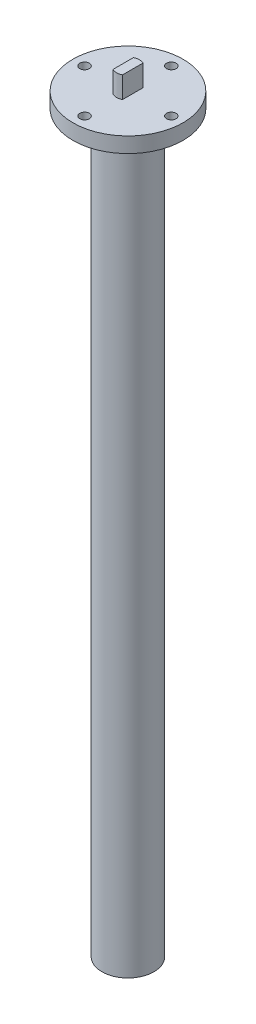
ISO-10303-21;
HEADER;
FILE_DESCRIPTION(('STEP AP214'),'2;1');
FILE_NAME('part.step','',(''),(''),'','','');
FILE_SCHEMA(('AUTOMOTIVE_DESIGN { 1 0 10303 214 1 1 1 1 }'));
ENDSEC;
DATA;
#1=APPLICATION_CONTEXT('core data for automotive mechanical design processes');
#2=APPLICATION_PROTOCOL_DEFINITION('international standard','automotive_design',2000,#1);
#3=PRODUCT_CONTEXT('',#1,'mechanical');
#4=PRODUCT('Part','Part','',(#3));
#5=PRODUCT_RELATED_PRODUCT_CATEGORY('part','',(#4));
#6=PRODUCT_DEFINITION_FORMATION('','',#4);
#7=PRODUCT_DEFINITION_CONTEXT('part definition',#1,'design');
#8=PRODUCT_DEFINITION('design','',#6,#7);
#9=PRODUCT_DEFINITION_SHAPE('','',#8);
#10=(LENGTH_UNIT() NAMED_UNIT(*) SI_UNIT(.MILLI.,.METRE.));
#11=(NAMED_UNIT(*) PLANE_ANGLE_UNIT() SI_UNIT($,.RADIAN.));
#12=(NAMED_UNIT(*) SI_UNIT($,.STERADIAN.) SOLID_ANGLE_UNIT());
#13=UNCERTAINTY_MEASURE_WITH_UNIT(LENGTH_MEASURE(1.E-05),#10,'distance_accuracy_value','');
#14=(GEOMETRIC_REPRESENTATION_CONTEXT(3) GLOBAL_UNCERTAINTY_ASSIGNED_CONTEXT((#13)) GLOBAL_UNIT_ASSIGNED_CONTEXT((#10,
#11,#12)) REPRESENTATION_CONTEXT('',''));
#15=CARTESIAN_POINT('',(0.,0.,0.));
#16=DIRECTION('',(0.,0.,1.));
#17=DIRECTION('',(1.,0.,0.));
#18=AXIS2_PLACEMENT_3D('',#15,#16,#17);
#19=CARTESIAN_POINT('',(0.,6.35,0.));
#20=DIRECTION('',(0.,1.,0.));
#21=DIRECTION('',(0.,0.,1.));
#22=AXIS2_PLACEMENT_3D('',#19,#20,#21);
#23=PLANE('',#22);
#24=CARTESIAN_POINT('',(18.,6.35,-1.88539992297529E-13));
#25=DIRECTION('',(0.,1.,0.));
#26=DIRECTION('',(0.,0.,1.));
#27=AXIS2_PLACEMENT_3D('',#24,#25,#26);
#28=CIRCLE('',#27,1.984375);
#29=CARTESIAN_POINT('',(18.,6.35,1.98437499999981));
#30=VERTEX_POINT('',#29);
#31=EDGE_CURVE('E188',#30,#30,#28,.T.);
#32=ORIENTED_EDGE('',*,*,#31,.F.);
#33=EDGE_LOOP('',(#32));
#34=FACE_BOUND('',#33,.T.);
#35=CARTESIAN_POINT('',(0.,6.35,18.));
#36=DIRECTION('',(0.,1.,0.));
#37=DIRECTION('',(0.,0.,1.));
#38=AXIS2_PLACEMENT_3D('',#35,#36,#37);
#39=CIRCLE('',#38,1.984375);
#40=CARTESIAN_POINT('',(0.,6.35,19.984375));
#41=VERTEX_POINT('',#40);
#42=EDGE_CURVE('E184',#41,#41,#39,.T.);
#43=ORIENTED_EDGE('',*,*,#42,.F.);
#44=EDGE_LOOP('',(#43));
#45=FACE_BOUND('',#44,.T.);
#46=CARTESIAN_POINT('',(-18.,6.35,0.));
#47=DIRECTION('',(0.,1.,0.));
#48=DIRECTION('',(0.,0.,1.));
#49=AXIS2_PLACEMENT_3D('',#46,#47,#48);
#50=CIRCLE('',#49,1.984375);
#51=CARTESIAN_POINT('',(-18.,6.35,1.98437500000006));
#52=VERTEX_POINT('',#51);
#53=EDGE_CURVE('E180',#52,#52,#50,.T.);
#54=ORIENTED_EDGE('',*,*,#53,.F.);
#55=EDGE_LOOP('',(#54));
#56=FACE_BOUND('',#55,.T.);
#57=CARTESIAN_POINT('',(0.,6.35,-18.));
#58=DIRECTION('',(0.,1.,0.));
#59=DIRECTION('',(0.,0.,1.));
#60=AXIS2_PLACEMENT_3D('',#57,#58,#59);
#61=CIRCLE('',#60,1.984375);
#62=CARTESIAN_POINT('',(0.,6.35,-16.015625));
#63=VERTEX_POINT('',#62);
#64=EDGE_CURVE('E174',#63,#63,#61,.T.);
#65=ORIENTED_EDGE('',*,*,#64,.F.);
#66=EDGE_LOOP('',(#65));
#67=FACE_BOUND('',#66,.T.);
#68=CARTESIAN_POINT('',(0.,6.35,0.));
#69=DIRECTION('',(0.,1.,0.));
#70=DIRECTION('',(0.,0.,1.));
#71=AXIS2_PLACEMENT_3D('',#68,#69,#70);
#72=CIRCLE('',#71,22.86);
#73=CARTESIAN_POINT('',(0.,6.35,22.86));
#74=VERTEX_POINT('',#73);
#75=EDGE_CURVE('E112',#74,#74,#72,.T.);
#76=ORIENTED_EDGE('',*,*,#75,.T.);
#77=EDGE_LOOP('',(#76));
#78=FACE_BOUND('',#77,.T.);
#79=CARTESIAN_POINT('',(0.,6.35,0.));
#80=DIRECTION('',(0.,1.,0.));
#81=DIRECTION('',(0.,0.,1.));
#82=AXIS2_PLACEMENT_3D('',#79,#80,#81);
#83=CIRCLE('',#82,4.699);
#84=CARTESIAN_POINT('',(1.9685,6.35,-4.26680310654242));
#85=VERTEX_POINT('',#84);
#86=CARTESIAN_POINT('',(-1.9685,6.35,-4.26680310654242));
#87=VERTEX_POINT('',#86);
#88=EDGE_CURVE('E98',#85,#87,#83,.T.);
#89=ORIENTED_EDGE('',*,*,#88,.F.);
#90=DIRECTION('',(0.,0.,1.));
#91=VECTOR('',#90,1.);
#92=CARTESIAN_POINT('',(1.9685,6.35,0.));
#93=LINE('',#92,#91);
#94=CARTESIAN_POINT('',(1.9685,6.35,4.26680310654242));
#95=VERTEX_POINT('',#94);
#96=EDGE_CURVE('E48',#85,#95,#93,.T.);
#97=ORIENTED_EDGE('',*,*,#96,.T.);
#98=CARTESIAN_POINT('',(-1.9685,6.35,4.26680310654241));
#99=VERTEX_POINT('',#98);
#100=EDGE_CURVE('E53',#99,#95,#83,.T.);
#101=ORIENTED_EDGE('',*,*,#100,.F.);
#102=DIRECTION('',(0.,0.,1.));
#103=VECTOR('',#102,1.);
#104=CARTESIAN_POINT('',(-1.9685,6.35,0.));
#105=LINE('',#104,#103);
#106=EDGE_CURVE('E96',#87,#99,#105,.T.);
#107=ORIENTED_EDGE('',*,*,#106,.F.);
#108=EDGE_LOOP('',(#89,#97,#101,#107));
#109=FACE_BOUND('',#108,.T.);
#110=ADVANCED_FACE('F33',(#34,#45,#56,#67,#78,#109),#23,.T.);
#111=CARTESIAN_POINT('',(0.,6.35,0.));
#112=DIRECTION('',(0.,-1.,0.));
#113=DIRECTION('',(0.,0.,-1.));
#114=AXIS2_PLACEMENT_3D('',#111,#112,#113);
#115=CYLINDRICAL_SURFACE('',#114,22.86);
#116=ORIENTED_EDGE('',*,*,#75,.F.);
#117=EDGE_LOOP('',(#116));
#118=FACE_BOUND('',#117,.T.);
#119=CARTESIAN_POINT('',(0.,0.,0.));
#120=DIRECTION('',(0.,1.,0.));
#121=DIRECTION('',(0.,0.,1.));
#122=AXIS2_PLACEMENT_3D('',#119,#120,#121);
#123=CIRCLE('',#122,22.86);
#124=CARTESIAN_POINT('',(0.,0.,22.86));
#125=VERTEX_POINT('',#124);
#126=EDGE_CURVE('E80',#125,#125,#123,.T.);
#127=ORIENTED_EDGE('',*,*,#126,.T.);
#128=EDGE_LOOP('',(#127));
#129=FACE_BOUND('',#128,.T.);
#130=ADVANCED_FACE('F137',(#118,#129),#115,.T.);
#131=CARTESIAN_POINT('',(0.,0.,0.));
#132=DIRECTION('',(0.,1.,0.));
#133=DIRECTION('',(0.,0.,1.));
#134=AXIS2_PLACEMENT_3D('',#131,#132,#133);
#135=PLANE('',#134);
#136=CARTESIAN_POINT('',(18.,0.,-1.88539992297529E-13));
#137=DIRECTION('',(0.,1.,0.));
#138=DIRECTION('',(0.,0.,1.));
#139=AXIS2_PLACEMENT_3D('',#136,#137,#138);
#140=CIRCLE('',#139,1.984375);
#141=CARTESIAN_POINT('',(18.,0.,1.98437499999981));
#142=VERTEX_POINT('',#141);
#143=EDGE_CURVE('E158',#142,#142,#140,.T.);
#144=ORIENTED_EDGE('',*,*,#143,.T.);
#145=EDGE_LOOP('',(#144));
#146=FACE_BOUND('',#145,.T.);
#147=CARTESIAN_POINT('',(0.,0.,18.));
#148=DIRECTION('',(0.,1.,0.));
#149=DIRECTION('',(0.,0.,1.));
#150=AXIS2_PLACEMENT_3D('',#147,#148,#149);
#151=CIRCLE('',#150,1.984375);
#152=CARTESIAN_POINT('',(0.,0.,19.984375));
#153=VERTEX_POINT('',#152);
#154=EDGE_CURVE('E162',#153,#153,#151,.T.);
#155=ORIENTED_EDGE('',*,*,#154,.T.);
#156=EDGE_LOOP('',(#155));
#157=FACE_BOUND('',#156,.T.);
#158=CARTESIAN_POINT('',(-18.,0.,0.));
#159=DIRECTION('',(0.,1.,0.));
#160=DIRECTION('',(0.,0.,1.));
#161=AXIS2_PLACEMENT_3D('',#158,#159,#160);
#162=CIRCLE('',#161,1.984375);
#163=CARTESIAN_POINT('',(-18.,0.,1.98437500000006));
#164=VERTEX_POINT('',#163);
#165=EDGE_CURVE('E166',#164,#164,#162,.T.);
#166=ORIENTED_EDGE('',*,*,#165,.T.);
#167=EDGE_LOOP('',(#166));
#168=FACE_BOUND('',#167,.T.);
#169=CARTESIAN_POINT('',(0.,0.,-18.));
#170=DIRECTION('',(0.,1.,0.));
#171=DIRECTION('',(0.,0.,1.));
#172=AXIS2_PLACEMENT_3D('',#169,#170,#171);
#173=CIRCLE('',#172,1.984375);
#174=CARTESIAN_POINT('',(0.,0.,-16.015625));
#175=VERTEX_POINT('',#174);
#176=EDGE_CURVE('E170',#175,#175,#173,.T.);
#177=ORIENTED_EDGE('',*,*,#176,.T.);
#178=EDGE_LOOP('',(#177));
#179=FACE_BOUND('',#178,.T.);
#180=CARTESIAN_POINT('',(0.,0.,0.));
#181=DIRECTION('',(0.,1.,0.));
#182=DIRECTION('',(0.,0.,1.));
#183=AXIS2_PLACEMENT_3D('',#180,#181,#182);
#184=CIRCLE('',#183,14.6050000000003);
#185=CARTESIAN_POINT('',(0.,0.,14.6050000000003));
#186=VERTEX_POINT('',#185);
#187=EDGE_CURVE('E11',#186,#186,#184,.T.);
#188=ORIENTED_EDGE('',*,*,#187,.T.);
#189=EDGE_LOOP('',(#188));
#190=FACE_BOUND('',#189,.T.);
#191=ORIENTED_EDGE('',*,*,#126,.F.);
#192=EDGE_LOOP('',(#191));
#193=FACE_BOUND('',#192,.T.);
#194=ADVANCED_FACE('F143',(#146,#157,#168,#179,#190,#193),#135,.F.);
#195=CARTESIAN_POINT('',(1.9685,15.24,0.));
#196=DIRECTION('',(1.,0.,0.));
#197=DIRECTION('',(0.,0.,-1.));
#198=AXIS2_PLACEMENT_3D('',#195,#196,#197);
#199=PLANE('',#198);
#200=ORIENTED_EDGE('',*,*,#96,.F.);
#201=DIRECTION('',(0.,-1.,0.));
#202=VECTOR('',#201,1.);
#203=CARTESIAN_POINT('',(1.9685,15.24,-4.26680310654242));
#204=LINE('',#203,#202);
#205=CARTESIAN_POINT('',(1.9685,15.24,-4.26680310654242));
#206=VERTEX_POINT('',#205);
#207=EDGE_CURVE('E73',#206,#85,#204,.T.);
#208=ORIENTED_EDGE('',*,*,#207,.F.);
#209=DIRECTION('',(0.,0.,1.));
#210=VECTOR('',#209,1.);
#211=CARTESIAN_POINT('',(1.9685,15.24,0.));
#212=LINE('',#211,#210);
#213=CARTESIAN_POINT('',(1.9685,15.24,4.26680310654242));
#214=VERTEX_POINT('',#213);
#215=EDGE_CURVE('E77',#206,#214,#212,.T.);
#216=ORIENTED_EDGE('',*,*,#215,.T.);
#217=DIRECTION('',(0.,-1.,0.));
#218=VECTOR('',#217,1.);
#219=CARTESIAN_POINT('',(1.9685,15.24,4.26680310654242));
#220=LINE('',#219,#218);
#221=EDGE_CURVE('E106',#214,#95,#220,.T.);
#222=ORIENTED_EDGE('',*,*,#221,.T.);
#223=EDGE_LOOP('',(#200,#208,#216,#222));
#224=FACE_BOUND('',#223,.T.);
#225=ADVANCED_FACE('F75',(#224),#199,.T.);
#226=CARTESIAN_POINT('',(0.,15.24,0.));
#227=DIRECTION('',(0.,-1.,0.));
#228=DIRECTION('',(0.,0.,-1.));
#229=AXIS2_PLACEMENT_3D('',#226,#227,#228);
#230=CYLINDRICAL_SURFACE('',#229,4.699);
#231=ORIENTED_EDGE('',*,*,#88,.T.);
#232=DIRECTION('',(0.,-1.,0.));
#233=VECTOR('',#232,1.);
#234=CARTESIAN_POINT('',(-1.9685,15.24,-4.26680310654242));
#235=LINE('',#234,#233);
#236=CARTESIAN_POINT('',(-1.9685,15.24,-4.26680310654242));
#237=VERTEX_POINT('',#236);
#238=EDGE_CURVE('E81',#237,#87,#235,.T.);
#239=ORIENTED_EDGE('',*,*,#238,.F.);
#240=CARTESIAN_POINT('',(0.,15.24,0.));
#241=DIRECTION('',(0.,1.,0.));
#242=DIRECTION('',(0.,0.,1.));
#243=AXIS2_PLACEMENT_3D('',#240,#241,#242);
#244=CIRCLE('',#243,4.699);
#245=EDGE_CURVE('E84',#206,#237,#244,.T.);
#246=ORIENTED_EDGE('',*,*,#245,.F.);
#247=ORIENTED_EDGE('',*,*,#207,.T.);
#248=EDGE_LOOP('',(#231,#239,#246,#247));
#249=FACE_BOUND('',#248,.T.);
#250=ADVANCED_FACE('F85',(#249),#230,.T.);
#251=CARTESIAN_POINT('',(-1.9685,15.24,0.));
#252=DIRECTION('',(1.,0.,0.));
#253=DIRECTION('',(0.,0.,-1.));
#254=AXIS2_PLACEMENT_3D('',#251,#252,#253);
#255=PLANE('',#254);
#256=ORIENTED_EDGE('',*,*,#106,.T.);
#257=DIRECTION('',(0.,-1.,0.));
#258=VECTOR('',#257,1.);
#259=CARTESIAN_POINT('',(-1.9685,15.24,4.26680310654241));
#260=LINE('',#259,#258);
#261=CARTESIAN_POINT('',(-1.9685,15.24,4.26680310654241));
#262=VERTEX_POINT('',#261);
#263=EDGE_CURVE('E108',#262,#99,#260,.T.);
#264=ORIENTED_EDGE('',*,*,#263,.F.);
#265=DIRECTION('',(0.,0.,1.));
#266=VECTOR('',#265,1.);
#267=CARTESIAN_POINT('',(-1.9685,15.24,0.));
#268=LINE('',#267,#266);
#269=EDGE_CURVE('E89',#237,#262,#268,.T.);
#270=ORIENTED_EDGE('',*,*,#269,.F.);
#271=ORIENTED_EDGE('',*,*,#238,.T.);
#272=EDGE_LOOP('',(#256,#264,#270,#271));
#273=FACE_BOUND('',#272,.T.);
#274=ADVANCED_FACE('F211',(#273),#255,.F.);
#275=ORIENTED_EDGE('',*,*,#100,.T.);
#276=ORIENTED_EDGE('',*,*,#221,.F.);
#277=EDGE_CURVE('E91',#262,#214,#244,.T.);
#278=ORIENTED_EDGE('',*,*,#277,.F.);
#279=ORIENTED_EDGE('',*,*,#263,.T.);
#280=EDGE_LOOP('',(#275,#276,#278,#279));
#281=FACE_BOUND('',#280,.T.);
#282=ADVANCED_FACE('F209',(#281),#230,.T.);
#283=CARTESIAN_POINT('',(0.,15.24,0.));
#284=DIRECTION('',(0.,1.,0.));
#285=DIRECTION('',(0.,0.,1.));
#286=AXIS2_PLACEMENT_3D('',#283,#284,#285);
#287=PLANE('',#286);
#288=ORIENTED_EDGE('',*,*,#215,.F.);
#289=ORIENTED_EDGE('',*,*,#245,.T.);
#290=ORIENTED_EDGE('',*,*,#269,.T.);
#291=ORIENTED_EDGE('',*,*,#277,.T.);
#292=EDGE_LOOP('',(#288,#289,#290,#291));
#293=FACE_BOUND('',#292,.T.);
#294=ADVANCED_FACE('F92',(#293),#287,.T.);
#295=CARTESIAN_POINT('',(0.,-304.8,0.));
#296=DIRECTION('',(0.,1.,0.));
#297=DIRECTION('',(0.,0.,1.));
#298=AXIS2_PLACEMENT_3D('',#295,#296,#297);
#299=CYLINDRICAL_SURFACE('',#298,10.795);
#300=CARTESIAN_POINT('',(0.,-3.81000000000037,0.));
#301=DIRECTION('',(0.,1.,0.));
#302=DIRECTION('',(0.,0.,1.));
#303=AXIS2_PLACEMENT_3D('',#300,#301,#302);
#304=CIRCLE('',#303,10.795);
#305=CARTESIAN_POINT('',(0.,-3.81000000000037,10.795));
#306=VERTEX_POINT('',#305);
#307=EDGE_CURVE('E41',#306,#306,#304,.F.);
#308=ORIENTED_EDGE('',*,*,#307,.T.);
#309=EDGE_LOOP('',(#308));
#310=FACE_BOUND('',#309,.T.);
#311=CARTESIAN_POINT('',(0.,-304.8,0.));
#312=DIRECTION('',(0.,-1.,0.));
#313=DIRECTION('',(0.,0.,-1.));
#314=AXIS2_PLACEMENT_3D('',#311,#312,#313);
#315=CIRCLE('',#314,10.795);
#316=CARTESIAN_POINT('',(0.,-304.8,-10.795));
#317=VERTEX_POINT('',#316);
#318=EDGE_CURVE('E100',#317,#317,#315,.T.);
#319=ORIENTED_EDGE('',*,*,#318,.F.);
#320=EDGE_LOOP('',(#319));
#321=FACE_BOUND('',#320,.T.);
#322=ADVANCED_FACE('F119',(#310,#321),#299,.T.);
#323=CARTESIAN_POINT('',(0.,-304.8,0.));
#324=DIRECTION('',(0.,-1.,0.));
#325=DIRECTION('',(0.,0.,-1.));
#326=AXIS2_PLACEMENT_3D('',#323,#324,#325);
#327=PLANE('',#326);
#328=ORIENTED_EDGE('',*,*,#318,.T.);
#329=EDGE_LOOP('',(#328));
#330=FACE_BOUND('',#329,.T.);
#331=ADVANCED_FACE('F124',(#330),#327,.T.);
#332=CARTESIAN_POINT('',(0.,-3.81000000000031,0.));
#333=DIRECTION('',(0.,1.,0.));
#334=DIRECTION('',(0.,0.,1.));
#335=AXIS2_PLACEMENT_3D('',#332,#333,#334);
#336=CONICAL_SURFACE('',#335,10.795,0.785398163397448);
#337=ORIENTED_EDGE('',*,*,#187,.F.);
#338=EDGE_LOOP('',(#337));
#339=FACE_BOUND('',#338,.T.);
#340=ORIENTED_EDGE('',*,*,#307,.F.);
#341=EDGE_LOOP('',(#340));
#342=FACE_BOUND('',#341,.T.);
#343=ADVANCED_FACE('F35',(#339,#342),#336,.T.);
#344=CARTESIAN_POINT('',(0.,6.35,-18.));
#345=DIRECTION('',(0.,1.,0.));
#346=DIRECTION('',(0.,0.,1.));
#347=AXIS2_PLACEMENT_3D('',#344,#345,#346);
#348=CYLINDRICAL_SURFACE('',#347,1.984375);
#349=ORIENTED_EDGE('',*,*,#176,.F.);
#350=EDGE_LOOP('',(#349));
#351=FACE_BOUND('',#350,.T.);
#352=ORIENTED_EDGE('',*,*,#64,.T.);
#353=EDGE_LOOP('',(#352));
#354=FACE_BOUND('',#353,.T.);
#355=ADVANCED_FACE('F123',(#351,#354),#348,.F.);
#356=CARTESIAN_POINT('',(-18.,6.35,0.));
#357=DIRECTION('',(0.,1.,0.));
#358=DIRECTION('',(0.,0.,1.));
#359=AXIS2_PLACEMENT_3D('',#356,#357,#358);
#360=CYLINDRICAL_SURFACE('',#359,1.984375);
#361=ORIENTED_EDGE('',*,*,#165,.F.);
#362=EDGE_LOOP('',(#361));
#363=FACE_BOUND('',#362,.T.);
#364=ORIENTED_EDGE('',*,*,#53,.T.);
#365=EDGE_LOOP('',(#364));
#366=FACE_BOUND('',#365,.T.);
#367=ADVANCED_FACE('F130',(#363,#366),#360,.F.);
#368=CARTESIAN_POINT('',(0.,6.35,18.));
#369=DIRECTION('',(0.,1.,0.));
#370=DIRECTION('',(0.,0.,1.));
#371=AXIS2_PLACEMENT_3D('',#368,#369,#370);
#372=CYLINDRICAL_SURFACE('',#371,1.984375);
#373=ORIENTED_EDGE('',*,*,#154,.F.);
#374=EDGE_LOOP('',(#373));
#375=FACE_BOUND('',#374,.T.);
#376=ORIENTED_EDGE('',*,*,#42,.T.);
#377=EDGE_LOOP('',(#376));
#378=FACE_BOUND('',#377,.T.);
#379=ADVANCED_FACE('F193',(#375,#378),#372,.F.);
#380=CARTESIAN_POINT('',(18.,6.35,-1.88539992297529E-13));
#381=DIRECTION('',(0.,1.,0.));
#382=DIRECTION('',(0.,0.,1.));
#383=AXIS2_PLACEMENT_3D('',#380,#381,#382);
#384=CYLINDRICAL_SURFACE('',#383,1.984375);
#385=ORIENTED_EDGE('',*,*,#143,.F.);
#386=EDGE_LOOP('',(#385));
#387=FACE_BOUND('',#386,.T.);
#388=ORIENTED_EDGE('',*,*,#31,.T.);
#389=EDGE_LOOP('',(#388));
#390=FACE_BOUND('',#389,.T.);
#391=ADVANCED_FACE('F191',(#387,#390),#384,.F.);
#392=CLOSED_SHELL('',(#110,#130,#194,#225,#250,#274,#282,#294,#322,#331,#343,#355,#367,#379,#391));
#393=MANIFOLD_SOLID_BREP('B2',#392);
#394=ADVANCED_BREP_SHAPE_REPRESENTATION('',(#18,#393),#14);
#395=SHAPE_DEFINITION_REPRESENTATION(#9,#394);
ENDSEC;
END-ISO-10303-21;
